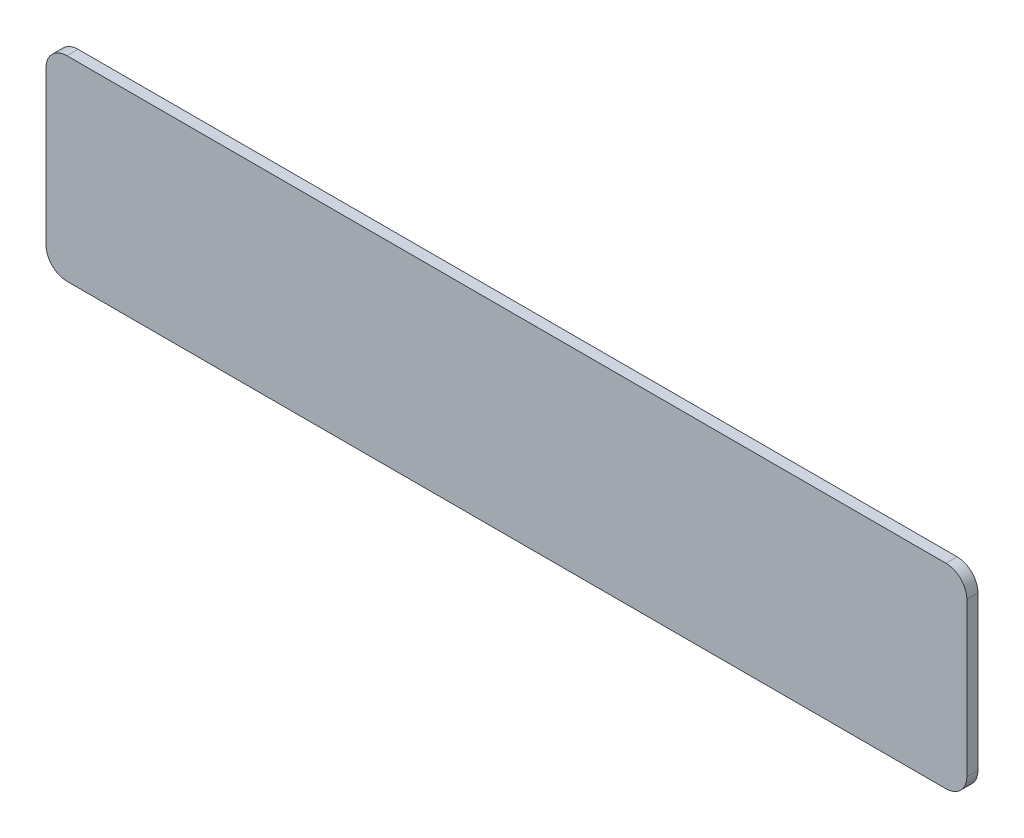
ISO-10303-21;
HEADER;
FILE_DESCRIPTION(('STEP AP214'),'2;1');
FILE_NAME('part.step','',(''),(''),'','','');
FILE_SCHEMA(('AUTOMOTIVE_DESIGN { 1 0 10303 214 1 1 1 1 }'));
ENDSEC;
DATA;
#1=APPLICATION_CONTEXT('core data for automotive mechanical design processes');
#2=APPLICATION_PROTOCOL_DEFINITION('international standard','automotive_design',2000,#1);
#3=PRODUCT_CONTEXT('',#1,'mechanical');
#4=PRODUCT('Part','Part','',(#3));
#5=PRODUCT_RELATED_PRODUCT_CATEGORY('part','',(#4));
#6=PRODUCT_DEFINITION_FORMATION('','',#4);
#7=PRODUCT_DEFINITION_CONTEXT('part definition',#1,'design');
#8=PRODUCT_DEFINITION('design','',#6,#7);
#9=PRODUCT_DEFINITION_SHAPE('','',#8);
#10=(LENGTH_UNIT() NAMED_UNIT(*) SI_UNIT(.MILLI.,.METRE.));
#11=(NAMED_UNIT(*) PLANE_ANGLE_UNIT() SI_UNIT($,.RADIAN.));
#12=(NAMED_UNIT(*) SI_UNIT($,.STERADIAN.) SOLID_ANGLE_UNIT());
#13=UNCERTAINTY_MEASURE_WITH_UNIT(LENGTH_MEASURE(1.E-05),#10,'distance_accuracy_value','');
#14=(GEOMETRIC_REPRESENTATION_CONTEXT(3) GLOBAL_UNCERTAINTY_ASSIGNED_CONTEXT((#13)) GLOBAL_UNIT_ASSIGNED_CONTEXT((#10,
#11,#12)) REPRESENTATION_CONTEXT('',''));
#15=CARTESIAN_POINT('',(0.,0.,0.));
#16=DIRECTION('',(0.,0.,1.));
#17=DIRECTION('',(1.,0.,0.));
#18=AXIS2_PLACEMENT_3D('',#15,#16,#17);
#19=CARTESIAN_POINT('',(129.,3.,1.6));
#20=DIRECTION('',(0.,0.,-1.));
#21=DIRECTION('',(-1.,0.,0.));
#22=AXIS2_PLACEMENT_3D('',#19,#20,#21);
#23=CYLINDRICAL_SURFACE('',#22,3.);
#24=CARTESIAN_POINT('',(129.,3.,0.));
#25=DIRECTION('',(0.,0.,1.));
#26=DIRECTION('',(1.,0.,0.));
#27=AXIS2_PLACEMENT_3D('',#24,#25,#26);
#28=CIRCLE('',#27,3.);
#29=CARTESIAN_POINT('',(129.,0.,0.));
#30=VERTEX_POINT('',#29);
#31=CARTESIAN_POINT('',(132.,3.,0.));
#32=VERTEX_POINT('',#31);
#33=EDGE_CURVE('E128',#30,#32,#28,.T.);
#34=ORIENTED_EDGE('',*,*,#33,.T.);
#35=DIRECTION('',(0.,0.,-1.));
#36=VECTOR('',#35,1.);
#37=CARTESIAN_POINT('',(132.,3.,1.6));
#38=LINE('',#37,#36);
#39=CARTESIAN_POINT('',(132.,3.,1.6));
#40=VERTEX_POINT('',#39);
#41=EDGE_CURVE('E11',#40,#32,#38,.T.);
#42=ORIENTED_EDGE('',*,*,#41,.F.);
#43=CARTESIAN_POINT('',(129.,3.,1.6));
#44=DIRECTION('',(0.,0.,1.));
#45=DIRECTION('',(1.,0.,0.));
#46=AXIS2_PLACEMENT_3D('',#43,#44,#45);
#47=CIRCLE('',#46,3.);
#48=CARTESIAN_POINT('',(129.,0.,1.6));
#49=VERTEX_POINT('',#48);
#50=EDGE_CURVE('E142',#49,#40,#47,.T.);
#51=ORIENTED_EDGE('',*,*,#50,.F.);
#52=DIRECTION('',(0.,0.,-1.));
#53=VECTOR('',#52,1.);
#54=CARTESIAN_POINT('',(129.,0.,1.6));
#55=LINE('',#54,#53);
#56=EDGE_CURVE('E124',#49,#30,#55,.T.);
#57=ORIENTED_EDGE('',*,*,#56,.T.);
#58=EDGE_LOOP('',(#34,#42,#51,#57));
#59=FACE_BOUND('',#58,.T.);
#60=ADVANCED_FACE('F32',(#59),#23,.T.);
#61=CARTESIAN_POINT('',(132.,3.,1.6));
#62=DIRECTION('',(-1.,0.,0.));
#63=DIRECTION('',(0.,0.,1.));
#64=AXIS2_PLACEMENT_3D('',#61,#62,#63);
#65=PLANE('',#64);
#66=DIRECTION('',(0.,1.,0.));
#67=VECTOR('',#66,1.);
#68=CARTESIAN_POINT('',(132.,3.,0.));
#69=LINE('',#68,#67);
#70=CARTESIAN_POINT('',(132.,25.,0.));
#71=VERTEX_POINT('',#70);
#72=EDGE_CURVE('E131',#32,#71,#69,.T.);
#73=ORIENTED_EDGE('',*,*,#72,.T.);
#74=DIRECTION('',(0.,0.,-1.));
#75=VECTOR('',#74,1.);
#76=CARTESIAN_POINT('',(132.,25.,1.6));
#77=LINE('',#76,#75);
#78=CARTESIAN_POINT('',(132.,25.,1.6));
#79=VERTEX_POINT('',#78);
#80=EDGE_CURVE('E40',#79,#71,#77,.T.);
#81=ORIENTED_EDGE('',*,*,#80,.F.);
#82=DIRECTION('',(0.,1.,0.));
#83=VECTOR('',#82,1.);
#84=CARTESIAN_POINT('',(132.,3.,1.6));
#85=LINE('',#84,#83);
#86=EDGE_CURVE('E91',#40,#79,#85,.T.);
#87=ORIENTED_EDGE('',*,*,#86,.F.);
#88=ORIENTED_EDGE('',*,*,#41,.T.);
#89=EDGE_LOOP('',(#73,#81,#87,#88));
#90=FACE_BOUND('',#89,.T.);
#91=ADVANCED_FACE('F177',(#90),#65,.F.);
#92=CARTESIAN_POINT('',(129.,25.,1.6));
#93=DIRECTION('',(0.,0.,-1.));
#94=DIRECTION('',(-1.,0.,0.));
#95=AXIS2_PLACEMENT_3D('',#92,#93,#94);
#96=CYLINDRICAL_SURFACE('',#95,3.);
#97=CARTESIAN_POINT('',(129.,25.,0.));
#98=DIRECTION('',(0.,0.,1.));
#99=DIRECTION('',(-1.,0.,0.));
#100=AXIS2_PLACEMENT_3D('',#97,#98,#99);
#101=CIRCLE('',#100,3.);
#102=CARTESIAN_POINT('',(129.,28.,0.));
#103=VERTEX_POINT('',#102);
#104=EDGE_CURVE('E133',#71,#103,#101,.T.);
#105=ORIENTED_EDGE('',*,*,#104,.T.);
#106=DIRECTION('',(0.,0.,-1.));
#107=VECTOR('',#106,1.);
#108=CARTESIAN_POINT('',(129.,28.,1.6));
#109=LINE('',#108,#107);
#110=CARTESIAN_POINT('',(129.,28.,1.6));
#111=VERTEX_POINT('',#110);
#112=EDGE_CURVE('E149',#111,#103,#109,.T.);
#113=ORIENTED_EDGE('',*,*,#112,.F.);
#114=CARTESIAN_POINT('',(129.,25.,1.6));
#115=DIRECTION('',(0.,0.,1.));
#116=DIRECTION('',(-1.,0.,0.));
#117=AXIS2_PLACEMENT_3D('',#114,#115,#116);
#118=CIRCLE('',#117,3.);
#119=EDGE_CURVE('E157',#79,#111,#118,.T.);
#120=ORIENTED_EDGE('',*,*,#119,.F.);
#121=ORIENTED_EDGE('',*,*,#80,.T.);
#122=EDGE_LOOP('',(#105,#113,#120,#121));
#123=FACE_BOUND('',#122,.T.);
#124=ADVANCED_FACE('F155',(#123),#96,.T.);
#125=CARTESIAN_POINT('',(3.00000000000002,28.,1.6));
#126=DIRECTION('',(0.,-1.,0.));
#127=DIRECTION('',(1.,0.,0.));
#128=AXIS2_PLACEMENT_3D('',#125,#126,#127);
#129=PLANE('',#128);
#130=DIRECTION('',(-1.,0.,0.));
#131=VECTOR('',#130,1.);
#132=CARTESIAN_POINT('',(3.00000000000002,28.,0.));
#133=LINE('',#132,#131);
#134=CARTESIAN_POINT('',(3.00000000000002,28.,0.));
#135=VERTEX_POINT('',#134);
#136=EDGE_CURVE('E135',#103,#135,#133,.T.);
#137=ORIENTED_EDGE('',*,*,#136,.T.);
#138=DIRECTION('',(0.,0.,-1.));
#139=VECTOR('',#138,1.);
#140=CARTESIAN_POINT('',(3.00000000000002,28.,1.6));
#141=LINE('',#140,#139);
#142=CARTESIAN_POINT('',(3.00000000000002,28.,1.6));
#143=VERTEX_POINT('',#142);
#144=EDGE_CURVE('E146',#143,#135,#141,.T.);
#145=ORIENTED_EDGE('',*,*,#144,.F.);
#146=DIRECTION('',(-1.,0.,0.));
#147=VECTOR('',#146,1.);
#148=CARTESIAN_POINT('',(3.00000000000002,28.,1.6));
#149=LINE('',#148,#147);
#150=EDGE_CURVE('E169',#111,#143,#149,.T.);
#151=ORIENTED_EDGE('',*,*,#150,.F.);
#152=ORIENTED_EDGE('',*,*,#112,.T.);
#153=EDGE_LOOP('',(#137,#145,#151,#152));
#154=FACE_BOUND('',#153,.T.);
#155=ADVANCED_FACE('F165',(#154),#129,.F.);
#156=CARTESIAN_POINT('',(3.,25.,1.6));
#157=DIRECTION('',(0.,0.,-1.));
#158=DIRECTION('',(-1.,0.,0.));
#159=AXIS2_PLACEMENT_3D('',#156,#157,#158);
#160=CYLINDRICAL_SURFACE('',#159,3.);
#161=CARTESIAN_POINT('',(3.,25.,0.));
#162=DIRECTION('',(0.,0.,1.));
#163=DIRECTION('',(-1.,0.,0.));
#164=AXIS2_PLACEMENT_3D('',#161,#162,#163);
#165=CIRCLE('',#164,3.);
#166=CARTESIAN_POINT('',(0.,25.,0.));
#167=VERTEX_POINT('',#166);
#168=EDGE_CURVE('E137',#135,#167,#165,.T.);
#169=ORIENTED_EDGE('',*,*,#168,.T.);
#170=DIRECTION('',(0.,0.,-1.));
#171=VECTOR('',#170,1.);
#172=CARTESIAN_POINT('',(0.,25.,1.6));
#173=LINE('',#172,#171);
#174=CARTESIAN_POINT('',(0.,25.,1.6));
#175=VERTEX_POINT('',#174);
#176=EDGE_CURVE('E119',#175,#167,#173,.T.);
#177=ORIENTED_EDGE('',*,*,#176,.F.);
#178=CARTESIAN_POINT('',(3.,25.,1.6));
#179=DIRECTION('',(0.,0.,1.));
#180=DIRECTION('',(-1.,0.,0.));
#181=AXIS2_PLACEMENT_3D('',#178,#179,#180);
#182=CIRCLE('',#181,3.);
#183=EDGE_CURVE('E110',#143,#175,#182,.T.);
#184=ORIENTED_EDGE('',*,*,#183,.F.);
#185=ORIENTED_EDGE('',*,*,#144,.T.);
#186=EDGE_LOOP('',(#169,#177,#184,#185));
#187=FACE_BOUND('',#186,.T.);
#188=ADVANCED_FACE('F168',(#187),#160,.T.);
#189=CARTESIAN_POINT('',(0.,3.00000000000002,1.6));
#190=DIRECTION('',(1.,0.,0.));
#191=DIRECTION('',(0.,0.,-1.));
#192=AXIS2_PLACEMENT_3D('',#189,#190,#191);
#193=PLANE('',#192);
#194=DIRECTION('',(0.,-1.,0.));
#195=VECTOR('',#194,1.);
#196=CARTESIAN_POINT('',(0.,3.00000000000002,0.));
#197=LINE('',#196,#195);
#198=CARTESIAN_POINT('',(0.,3.00000000000002,0.));
#199=VERTEX_POINT('',#198);
#200=EDGE_CURVE('E118',#167,#199,#197,.T.);
#201=ORIENTED_EDGE('',*,*,#200,.T.);
#202=DIRECTION('',(0.,0.,-1.));
#203=VECTOR('',#202,1.);
#204=CARTESIAN_POINT('',(0.,3.00000000000002,1.6));
#205=LINE('',#204,#203);
#206=CARTESIAN_POINT('',(0.,3.00000000000002,1.6));
#207=VERTEX_POINT('',#206);
#208=EDGE_CURVE('E115',#207,#199,#205,.T.);
#209=ORIENTED_EDGE('',*,*,#208,.F.);
#210=DIRECTION('',(0.,-1.,0.));
#211=VECTOR('',#210,1.);
#212=CARTESIAN_POINT('',(0.,3.00000000000002,1.6));
#213=LINE('',#212,#211);
#214=EDGE_CURVE('E104',#175,#207,#213,.T.);
#215=ORIENTED_EDGE('',*,*,#214,.F.);
#216=ORIENTED_EDGE('',*,*,#176,.T.);
#217=EDGE_LOOP('',(#201,#209,#215,#216));
#218=FACE_BOUND('',#217,.T.);
#219=ADVANCED_FACE('F116',(#218),#193,.F.);
#220=CARTESIAN_POINT('',(3.,3.,1.6));
#221=DIRECTION('',(0.,0.,-1.));
#222=DIRECTION('',(-1.,0.,0.));
#223=AXIS2_PLACEMENT_3D('',#220,#221,#222);
#224=CYLINDRICAL_SURFACE('',#223,3.);
#225=CARTESIAN_POINT('',(3.,3.,0.));
#226=DIRECTION('',(0.,0.,1.));
#227=DIRECTION('',(-1.,0.,0.));
#228=AXIS2_PLACEMENT_3D('',#225,#226,#227);
#229=CIRCLE('',#228,3.);
#230=CARTESIAN_POINT('',(3.00000000000002,0.,0.));
#231=VERTEX_POINT('',#230);
#232=EDGE_CURVE('E77',#199,#231,#229,.T.);
#233=ORIENTED_EDGE('',*,*,#232,.T.);
#234=DIRECTION('',(0.,0.,-1.));
#235=VECTOR('',#234,1.);
#236=CARTESIAN_POINT('',(3.00000000000002,0.,1.6));
#237=LINE('',#236,#235);
#238=CARTESIAN_POINT('',(3.00000000000002,0.,1.6));
#239=VERTEX_POINT('',#238);
#240=EDGE_CURVE('E120',#239,#231,#237,.T.);
#241=ORIENTED_EDGE('',*,*,#240,.F.);
#242=CARTESIAN_POINT('',(3.,3.,1.6));
#243=DIRECTION('',(0.,0.,1.));
#244=DIRECTION('',(-1.,0.,0.));
#245=AXIS2_PLACEMENT_3D('',#242,#243,#244);
#246=CIRCLE('',#245,3.);
#247=EDGE_CURVE('E108',#207,#239,#246,.T.);
#248=ORIENTED_EDGE('',*,*,#247,.F.);
#249=ORIENTED_EDGE('',*,*,#208,.T.);
#250=EDGE_LOOP('',(#233,#241,#248,#249));
#251=FACE_BOUND('',#250,.T.);
#252=ADVANCED_FACE('F122',(#251),#224,.T.);
#253=CARTESIAN_POINT('',(3.00000000000002,0.,1.6));
#254=DIRECTION('',(0.,1.,0.));
#255=DIRECTION('',(0.,0.,1.));
#256=AXIS2_PLACEMENT_3D('',#253,#254,#255);
#257=PLANE('',#256);
#258=DIRECTION('',(1.,0.,0.));
#259=VECTOR('',#258,1.);
#260=CARTESIAN_POINT('',(3.00000000000002,0.,0.));
#261=LINE('',#260,#259);
#262=EDGE_CURVE('E83',#231,#30,#261,.T.);
#263=ORIENTED_EDGE('',*,*,#262,.T.);
#264=ORIENTED_EDGE('',*,*,#56,.F.);
#265=DIRECTION('',(1.,0.,0.));
#266=VECTOR('',#265,1.);
#267=CARTESIAN_POINT('',(3.00000000000002,0.,1.6));
#268=LINE('',#267,#266);
#269=EDGE_CURVE('E48',#239,#49,#268,.T.);
#270=ORIENTED_EDGE('',*,*,#269,.F.);
#271=ORIENTED_EDGE('',*,*,#240,.T.);
#272=EDGE_LOOP('',(#263,#264,#270,#271));
#273=FACE_BOUND('',#272,.T.);
#274=ADVANCED_FACE('F193',(#273),#257,.F.);
#275=CARTESIAN_POINT('',(129.,3.,1.6));
#276=DIRECTION('',(0.,0.,1.));
#277=DIRECTION('',(1.,0.,0.));
#278=AXIS2_PLACEMENT_3D('',#275,#276,#277);
#279=PLANE('',#278);
#280=ORIENTED_EDGE('',*,*,#50,.T.);
#281=ORIENTED_EDGE('',*,*,#86,.T.);
#282=ORIENTED_EDGE('',*,*,#119,.T.);
#283=ORIENTED_EDGE('',*,*,#150,.T.);
#284=ORIENTED_EDGE('',*,*,#183,.T.);
#285=ORIENTED_EDGE('',*,*,#214,.T.);
#286=ORIENTED_EDGE('',*,*,#247,.T.);
#287=ORIENTED_EDGE('',*,*,#269,.T.);
#288=EDGE_LOOP('',(#280,#281,#282,#283,#284,#285,#286,#287));
#289=FACE_BOUND('',#288,.T.);
#290=ADVANCED_FACE('F106',(#289),#279,.T.);
#291=CARTESIAN_POINT('',(129.,3.,0.));
#292=DIRECTION('',(0.,0.,1.));
#293=DIRECTION('',(1.,0.,0.));
#294=AXIS2_PLACEMENT_3D('',#291,#292,#293);
#295=PLANE('',#294);
#296=ORIENTED_EDGE('',*,*,#33,.F.);
#297=ORIENTED_EDGE('',*,*,#262,.F.);
#298=ORIENTED_EDGE('',*,*,#232,.F.);
#299=ORIENTED_EDGE('',*,*,#200,.F.);
#300=ORIENTED_EDGE('',*,*,#168,.F.);
#301=ORIENTED_EDGE('',*,*,#136,.F.);
#302=ORIENTED_EDGE('',*,*,#104,.F.);
#303=ORIENTED_EDGE('',*,*,#72,.F.);
#304=EDGE_LOOP('',(#296,#297,#298,#299,#300,#301,#302,#303));
#305=FACE_BOUND('',#304,.T.);
#306=ADVANCED_FACE('F161',(#305),#295,.F.);
#307=CLOSED_SHELL('',(#60,#91,#124,#155,#188,#219,#252,#274,#290,#306));
#308=MANIFOLD_SOLID_BREP('B2',#307);
#309=ADVANCED_BREP_SHAPE_REPRESENTATION('',(#18,#308),#14);
#310=SHAPE_DEFINITION_REPRESENTATION(#9,#309);
ENDSEC;
END-ISO-10303-21;
